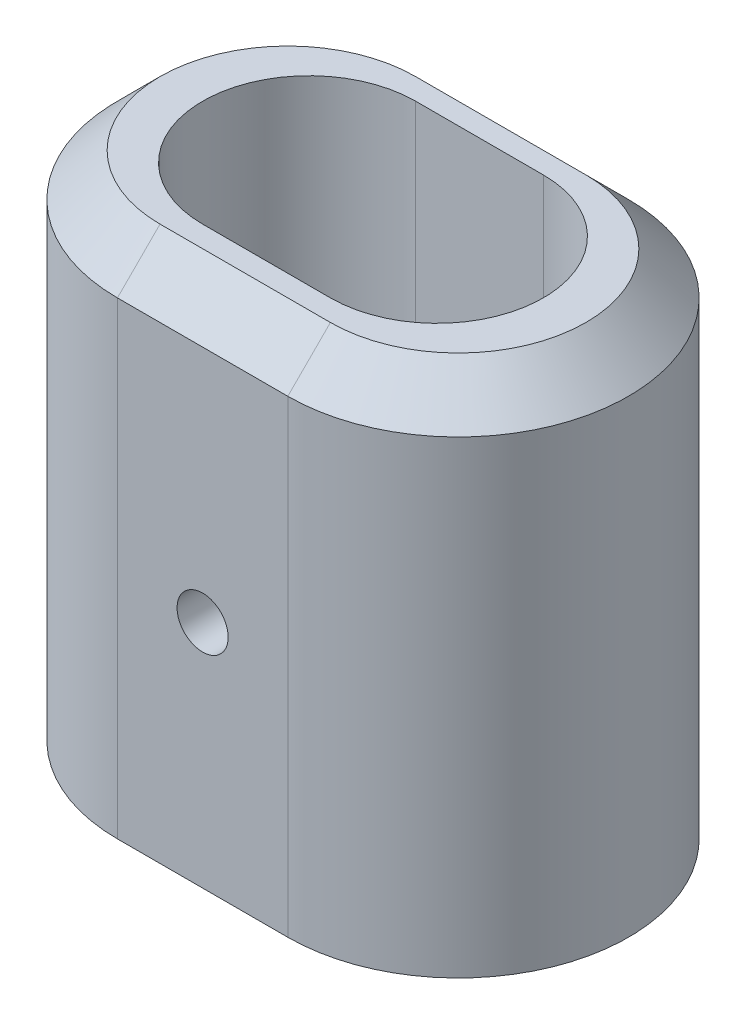
ISO-10303-21;
HEADER;
FILE_DESCRIPTION(('STEP AP214'),'2;1');
FILE_NAME('part.step','',(''),(''),'','','');
FILE_SCHEMA(('AUTOMOTIVE_DESIGN { 1 0 10303 214 1 1 1 1 }'));
ENDSEC;
DATA;
#1=APPLICATION_CONTEXT('core data for automotive mechanical design processes');
#2=APPLICATION_PROTOCOL_DEFINITION('international standard','automotive_design',2000,#1);
#3=PRODUCT_CONTEXT('',#1,'mechanical');
#4=PRODUCT('Part','Part','',(#3));
#5=PRODUCT_RELATED_PRODUCT_CATEGORY('part','',(#4));
#6=PRODUCT_DEFINITION_FORMATION('','',#4);
#7=PRODUCT_DEFINITION_CONTEXT('part definition',#1,'design');
#8=PRODUCT_DEFINITION('design','',#6,#7);
#9=PRODUCT_DEFINITION_SHAPE('','',#8);
#10=(LENGTH_UNIT() NAMED_UNIT(*) SI_UNIT(.MILLI.,.METRE.));
#11=(NAMED_UNIT(*) PLANE_ANGLE_UNIT() SI_UNIT($,.RADIAN.));
#12=(NAMED_UNIT(*) SI_UNIT($,.STERADIAN.) SOLID_ANGLE_UNIT());
#13=UNCERTAINTY_MEASURE_WITH_UNIT(LENGTH_MEASURE(1.E-05),#10,'distance_accuracy_value','');
#14=(GEOMETRIC_REPRESENTATION_CONTEXT(3) GLOBAL_UNCERTAINTY_ASSIGNED_CONTEXT((#13)) GLOBAL_UNIT_ASSIGNED_CONTEXT((#10,
#11,#12)) REPRESENTATION_CONTEXT('',''));
#15=CARTESIAN_POINT('',(0.,0.,0.));
#16=DIRECTION('',(0.,0.,1.));
#17=DIRECTION('',(1.,0.,0.));
#18=AXIS2_PLACEMENT_3D('',#15,#16,#17);
#19=CARTESIAN_POINT('',(-2.5,60.,0.));
#20=DIRECTION('',(0.,1.,0.));
#21=DIRECTION('',(0.,0.,1.));
#22=AXIS2_PLACEMENT_3D('',#19,#20,#21);
#23=PLANE('',#22);
#24=DIRECTION('',(-1.,0.,0.));
#25=VECTOR('',#24,1.);
#26=CARTESIAN_POINT('',(-2.5,60.,-15.));
#27=LINE('',#26,#25);
#28=CARTESIAN_POINT('',(17.5,60.,-15.));
#29=VERTEX_POINT('',#28);
#30=CARTESIAN_POINT('',(-2.5,60.,-15.));
#31=VERTEX_POINT('',#30);
#32=EDGE_CURVE('E185',#29,#31,#27,.T.);
#33=ORIENTED_EDGE('',*,*,#32,.T.);
#34=CARTESIAN_POINT('',(-2.5,60.,0.));
#35=DIRECTION('',(0.,1.,0.));
#36=DIRECTION('',(0.,0.,1.));
#37=AXIS2_PLACEMENT_3D('',#34,#35,#36);
#38=CIRCLE('',#37,15.);
#39=CARTESIAN_POINT('',(-2.5,60.,15.));
#40=VERTEX_POINT('',#39);
#41=EDGE_CURVE('E187',#31,#40,#38,.T.);
#42=ORIENTED_EDGE('',*,*,#41,.T.);
#43=DIRECTION('',(1.,0.,0.));
#44=VECTOR('',#43,1.);
#45=CARTESIAN_POINT('',(17.5,60.,15.));
#46=LINE('',#45,#44);
#47=CARTESIAN_POINT('',(17.5,60.,15.));
#48=VERTEX_POINT('',#47);
#49=EDGE_CURVE('E181',#40,#48,#46,.T.);
#50=ORIENTED_EDGE('',*,*,#49,.T.);
#51=CARTESIAN_POINT('',(17.5,60.,0.));
#52=DIRECTION('',(0.,1.,0.));
#53=DIRECTION('',(0.,0.,1.));
#54=AXIS2_PLACEMENT_3D('',#51,#52,#53);
#55=CIRCLE('',#54,15.);
#56=EDGE_CURVE('E183',#48,#29,#55,.T.);
#57=ORIENTED_EDGE('',*,*,#56,.T.);
#58=EDGE_LOOP('',(#33,#42,#50,#57));
#59=FACE_BOUND('',#58,.T.);
#60=DIRECTION('',(1.,0.,0.));
#61=VECTOR('',#60,1.);
#62=CARTESIAN_POINT('',(0.,60.,12.5));
#63=LINE('',#62,#61);
#64=CARTESIAN_POINT('',(0.,60.,12.5));
#65=VERTEX_POINT('',#64);
#66=CARTESIAN_POINT('',(15.,60.,12.5));
#67=VERTEX_POINT('',#66);
#68=EDGE_CURVE('E129',#65,#67,#63,.T.);
#69=ORIENTED_EDGE('',*,*,#68,.F.);
#70=CARTESIAN_POINT('',(0.,60.,0.));
#71=DIRECTION('',(0.,1.,0.));
#72=DIRECTION('',(0.,0.,1.));
#73=AXIS2_PLACEMENT_3D('',#70,#71,#72);
#74=CIRCLE('',#73,12.5);
#75=CARTESIAN_POINT('',(0.,60.,-12.5));
#76=VERTEX_POINT('',#75);
#77=EDGE_CURVE('E119',#76,#65,#74,.T.);
#78=ORIENTED_EDGE('',*,*,#77,.F.);
#79=DIRECTION('',(-1.,0.,0.));
#80=VECTOR('',#79,1.);
#81=CARTESIAN_POINT('',(0.,60.,-12.5));
#82=LINE('',#81,#80);
#83=CARTESIAN_POINT('',(15.,60.,-12.5));
#84=VERTEX_POINT('',#83);
#85=EDGE_CURVE('E144',#84,#76,#82,.T.);
#86=ORIENTED_EDGE('',*,*,#85,.F.);
#87=CARTESIAN_POINT('',(15.,60.,0.));
#88=DIRECTION('',(0.,1.,0.));
#89=DIRECTION('',(0.,0.,1.));
#90=AXIS2_PLACEMENT_3D('',#87,#88,#89);
#91=CIRCLE('',#90,12.5);
#92=EDGE_CURVE('E142',#67,#84,#91,.T.);
#93=ORIENTED_EDGE('',*,*,#92,.F.);
#94=EDGE_LOOP('',(#69,#78,#86,#93));
#95=FACE_BOUND('',#94,.T.);
#96=ADVANCED_FACE('F39',(#59,#95),#23,.T.);
#97=CARTESIAN_POINT('',(-2.5,0.,0.));
#98=DIRECTION('',(0.,1.,0.));
#99=DIRECTION('',(0.,0.,1.));
#100=AXIS2_PLACEMENT_3D('',#97,#98,#99);
#101=PLANE('',#100);
#102=CARTESIAN_POINT('',(-2.5,0.,0.));
#103=DIRECTION('',(0.,1.,0.));
#104=DIRECTION('',(0.,0.,1.));
#105=AXIS2_PLACEMENT_3D('',#102,#103,#104);
#106=CIRCLE('',#105,20.);
#107=CARTESIAN_POINT('',(-2.5,0.,-20.));
#108=VERTEX_POINT('',#107);
#109=CARTESIAN_POINT('',(-2.5,0.,20.));
#110=VERTEX_POINT('',#109);
#111=EDGE_CURVE('E137',#108,#110,#106,.T.);
#112=ORIENTED_EDGE('',*,*,#111,.F.);
#113=DIRECTION('',(-1.,0.,0.));
#114=VECTOR('',#113,1.);
#115=CARTESIAN_POINT('',(-2.5,0.,-20.));
#116=LINE('',#115,#114);
#117=CARTESIAN_POINT('',(17.5,0.,-20.));
#118=VERTEX_POINT('',#117);
#119=EDGE_CURVE('E170',#118,#108,#116,.T.);
#120=ORIENTED_EDGE('',*,*,#119,.F.);
#121=CARTESIAN_POINT('',(17.5,0.,0.));
#122=DIRECTION('',(0.,1.,0.));
#123=DIRECTION('',(0.,0.,1.));
#124=AXIS2_PLACEMENT_3D('',#121,#122,#123);
#125=CIRCLE('',#124,20.);
#126=CARTESIAN_POINT('',(17.5,0.,20.));
#127=VERTEX_POINT('',#126);
#128=EDGE_CURVE('E167',#127,#118,#125,.T.);
#129=ORIENTED_EDGE('',*,*,#128,.F.);
#130=DIRECTION('',(1.,0.,0.));
#131=VECTOR('',#130,1.);
#132=CARTESIAN_POINT('',(-2.5,0.,20.));
#133=LINE('',#132,#131);
#134=EDGE_CURVE('E164',#110,#127,#133,.T.);
#135=ORIENTED_EDGE('',*,*,#134,.F.);
#136=EDGE_LOOP('',(#112,#120,#129,#135));
#137=FACE_BOUND('',#136,.T.);
#138=CARTESIAN_POINT('',(0.,0.,0.));
#139=DIRECTION('',(0.,1.,0.));
#140=DIRECTION('',(0.,0.,1.));
#141=AXIS2_PLACEMENT_3D('',#138,#139,#140);
#142=CIRCLE('',#141,12.5);
#143=CARTESIAN_POINT('',(0.,0.,-12.5));
#144=VERTEX_POINT('',#143);
#145=CARTESIAN_POINT('',(0.,0.,12.5));
#146=VERTEX_POINT('',#145);
#147=EDGE_CURVE('E149',#144,#146,#142,.T.);
#148=ORIENTED_EDGE('',*,*,#147,.T.);
#149=DIRECTION('',(1.,0.,0.));
#150=VECTOR('',#149,1.);
#151=CARTESIAN_POINT('',(0.,0.,12.5));
#152=LINE('',#151,#150);
#153=CARTESIAN_POINT('',(15.,0.,12.5));
#154=VERTEX_POINT('',#153);
#155=EDGE_CURVE('E136',#146,#154,#152,.T.);
#156=ORIENTED_EDGE('',*,*,#155,.T.);
#157=CARTESIAN_POINT('',(15.,0.,0.));
#158=DIRECTION('',(0.,1.,0.));
#159=DIRECTION('',(0.,0.,1.));
#160=AXIS2_PLACEMENT_3D('',#157,#158,#159);
#161=CIRCLE('',#160,12.5);
#162=CARTESIAN_POINT('',(15.,0.,-12.5));
#163=VERTEX_POINT('',#162);
#164=EDGE_CURVE('E153',#154,#163,#161,.T.);
#165=ORIENTED_EDGE('',*,*,#164,.T.);
#166=DIRECTION('',(-1.,0.,0.));
#167=VECTOR('',#166,1.);
#168=CARTESIAN_POINT('',(0.,0.,-12.5));
#169=LINE('',#168,#167);
#170=EDGE_CURVE('E130',#163,#144,#169,.T.);
#171=ORIENTED_EDGE('',*,*,#170,.T.);
#172=EDGE_LOOP('',(#148,#156,#165,#171));
#173=FACE_BOUND('',#172,.T.);
#174=ADVANCED_FACE('F229',(#137,#173),#101,.F.);
#175=CARTESIAN_POINT('',(-2.5,60.,0.));
#176=DIRECTION('',(0.,-1.,0.));
#177=DIRECTION('',(0.,0.,-1.));
#178=AXIS2_PLACEMENT_3D('',#175,#176,#177);
#179=CYLINDRICAL_SURFACE('',#178,20.);
#180=DIRECTION('',(0.,-1.,0.));
#181=VECTOR('',#180,1.);
#182=CARTESIAN_POINT('',(-2.5,60.,20.));
#183=LINE('',#182,#181);
#184=CARTESIAN_POINT('',(-2.5,55.,20.));
#185=VERTEX_POINT('',#184);
#186=EDGE_CURVE('E179',#185,#110,#183,.T.);
#187=ORIENTED_EDGE('',*,*,#186,.F.);
#188=CARTESIAN_POINT('',(-2.5,55.,0.));
#189=DIRECTION('',(0.,1.,0.));
#190=DIRECTION('',(0.,0.,1.));
#191=AXIS2_PLACEMENT_3D('',#188,#189,#190);
#192=CIRCLE('',#191,20.);
#193=CARTESIAN_POINT('',(-2.5,55.,-20.));
#194=VERTEX_POINT('',#193);
#195=EDGE_CURVE('E190',#185,#194,#192,.F.);
#196=ORIENTED_EDGE('',*,*,#195,.T.);
#197=DIRECTION('',(0.,-1.,0.));
#198=VECTOR('',#197,1.);
#199=CARTESIAN_POINT('',(-2.5,60.,-20.));
#200=LINE('',#199,#198);
#201=EDGE_CURVE('E173',#194,#108,#200,.T.);
#202=ORIENTED_EDGE('',*,*,#201,.T.);
#203=ORIENTED_EDGE('',*,*,#111,.T.);
#204=EDGE_LOOP('',(#187,#196,#202,#203));
#205=FACE_BOUND('',#204,.T.);
#206=ADVANCED_FACE('F222',(#205),#179,.T.);
#207=CARTESIAN_POINT('',(-2.5,60.,20.));
#208=DIRECTION('',(0.,0.,-1.));
#209=DIRECTION('',(-1.,0.,0.));
#210=AXIS2_PLACEMENT_3D('',#207,#208,#209);
#211=PLANE('',#210);
#212=CARTESIAN_POINT('',(7.5,27.,20.));
#213=DIRECTION('',(0.,0.,1.));
#214=DIRECTION('',(1.,0.,0.));
#215=AXIS2_PLACEMENT_3D('',#212,#213,#214);
#216=CIRCLE('',#215,3.);
#217=CARTESIAN_POINT('',(10.5,27.,20.));
#218=VERTEX_POINT('',#217);
#219=EDGE_CURVE('E295',#218,#218,#216,.T.);
#220=ORIENTED_EDGE('',*,*,#219,.F.);
#221=EDGE_LOOP('',(#220));
#222=FACE_BOUND('',#221,.T.);
#223=DIRECTION('',(0.,-1.,0.));
#224=VECTOR('',#223,1.);
#225=CARTESIAN_POINT('',(17.5,60.,20.));
#226=LINE('',#225,#224);
#227=CARTESIAN_POINT('',(17.5,55.,20.));
#228=VERTEX_POINT('',#227);
#229=EDGE_CURVE('E177',#228,#127,#226,.T.);
#230=ORIENTED_EDGE('',*,*,#229,.F.);
#231=DIRECTION('',(-1.,0.,0.));
#232=VECTOR('',#231,1.);
#233=CARTESIAN_POINT('',(-2.5,55.,20.));
#234=LINE('',#233,#232);
#235=EDGE_CURVE('E11',#228,#185,#234,.T.);
#236=ORIENTED_EDGE('',*,*,#235,.T.);
#237=ORIENTED_EDGE('',*,*,#186,.T.);
#238=ORIENTED_EDGE('',*,*,#134,.T.);
#239=EDGE_LOOP('',(#230,#236,#237,#238));
#240=FACE_BOUND('',#239,.T.);
#241=ADVANCED_FACE('F218',(#222,#240),#211,.F.);
#242=CARTESIAN_POINT('',(17.5,60.,0.));
#243=DIRECTION('',(0.,-1.,0.));
#244=DIRECTION('',(0.,0.,-1.));
#245=AXIS2_PLACEMENT_3D('',#242,#243,#244);
#246=CYLINDRICAL_SURFACE('',#245,20.);
#247=DIRECTION('',(0.,-1.,0.));
#248=VECTOR('',#247,1.);
#249=CARTESIAN_POINT('',(17.5,60.,-20.));
#250=LINE('',#249,#248);
#251=CARTESIAN_POINT('',(17.5,55.,-20.));
#252=VERTEX_POINT('',#251);
#253=EDGE_CURVE('E175',#252,#118,#250,.T.);
#254=ORIENTED_EDGE('',*,*,#253,.F.);
#255=CARTESIAN_POINT('',(17.5,55.,0.));
#256=DIRECTION('',(0.,1.,0.));
#257=DIRECTION('',(0.,0.,1.));
#258=AXIS2_PLACEMENT_3D('',#255,#256,#257);
#259=CIRCLE('',#258,20.);
#260=EDGE_CURVE('E49',#252,#228,#259,.F.);
#261=ORIENTED_EDGE('',*,*,#260,.T.);
#262=ORIENTED_EDGE('',*,*,#229,.T.);
#263=ORIENTED_EDGE('',*,*,#128,.T.);
#264=EDGE_LOOP('',(#254,#261,#262,#263));
#265=FACE_BOUND('',#264,.T.);
#266=ADVANCED_FACE('F242',(#265),#246,.T.);
#267=CARTESIAN_POINT('',(-2.5,60.,-20.));
#268=DIRECTION('',(0.,0.,1.));
#269=DIRECTION('',(1.,0.,0.));
#270=AXIS2_PLACEMENT_3D('',#267,#268,#269);
#271=PLANE('',#270);
#272=CARTESIAN_POINT('',(7.5,27.,-20.));
#273=DIRECTION('',(0.,0.,1.));
#274=DIRECTION('',(1.,0.,0.));
#275=AXIS2_PLACEMENT_3D('',#272,#273,#274);
#276=CIRCLE('',#275,3.);
#277=CARTESIAN_POINT('',(10.5,27.,-20.));
#278=VERTEX_POINT('',#277);
#279=EDGE_CURVE('E198',#278,#278,#276,.T.);
#280=ORIENTED_EDGE('',*,*,#279,.T.);
#281=EDGE_LOOP('',(#280));
#282=FACE_BOUND('',#281,.T.);
#283=ORIENTED_EDGE('',*,*,#201,.F.);
#284=DIRECTION('',(1.,0.,0.));
#285=VECTOR('',#284,1.);
#286=CARTESIAN_POINT('',(17.5,55.,-20.));
#287=LINE('',#286,#285);
#288=EDGE_CURVE('E64',#194,#252,#287,.T.);
#289=ORIENTED_EDGE('',*,*,#288,.T.);
#290=ORIENTED_EDGE('',*,*,#253,.T.);
#291=ORIENTED_EDGE('',*,*,#119,.T.);
#292=EDGE_LOOP('',(#283,#289,#290,#291));
#293=FACE_BOUND('',#292,.T.);
#294=ADVANCED_FACE('F239',(#282,#293),#271,.F.);
#295=CARTESIAN_POINT('',(0.,60.,0.));
#296=DIRECTION('',(0.,-1.,0.));
#297=DIRECTION('',(0.,0.,-1.));
#298=AXIS2_PLACEMENT_3D('',#295,#296,#297);
#299=CYLINDRICAL_SURFACE('',#298,12.5);
#300=ORIENTED_EDGE('',*,*,#147,.F.);
#301=DIRECTION('',(0.,-1.,0.));
#302=VECTOR('',#301,1.);
#303=CARTESIAN_POINT('',(0.,60.,-12.5));
#304=LINE('',#303,#302);
#305=EDGE_CURVE('E125',#76,#144,#304,.T.);
#306=ORIENTED_EDGE('',*,*,#305,.F.);
#307=ORIENTED_EDGE('',*,*,#77,.T.);
#308=DIRECTION('',(0.,-1.,0.));
#309=VECTOR('',#308,1.);
#310=CARTESIAN_POINT('',(0.,60.,12.5));
#311=LINE('',#310,#309);
#312=EDGE_CURVE('E122',#65,#146,#311,.T.);
#313=ORIENTED_EDGE('',*,*,#312,.T.);
#314=EDGE_LOOP('',(#300,#306,#307,#313));
#315=FACE_BOUND('',#314,.T.);
#316=ADVANCED_FACE('F121',(#315),#299,.F.);
#317=CARTESIAN_POINT('',(0.,60.,12.5));
#318=DIRECTION('',(0.,0.,-1.));
#319=DIRECTION('',(-1.,0.,0.));
#320=AXIS2_PLACEMENT_3D('',#317,#318,#319);
#321=PLANE('',#320);
#322=CARTESIAN_POINT('',(7.5,27.,12.5));
#323=DIRECTION('',(0.,0.,-1.));
#324=DIRECTION('',(-1.,0.,0.));
#325=AXIS2_PLACEMENT_3D('',#322,#323,#324);
#326=CIRCLE('',#325,3.);
#327=CARTESIAN_POINT('',(4.5,27.,12.5));
#328=VERTEX_POINT('',#327);
#329=EDGE_CURVE('E290',#328,#328,#326,.T.);
#330=ORIENTED_EDGE('',*,*,#329,.F.);
#331=EDGE_LOOP('',(#330));
#332=FACE_BOUND('',#331,.T.);
#333=ORIENTED_EDGE('',*,*,#155,.F.);
#334=ORIENTED_EDGE('',*,*,#312,.F.);
#335=ORIENTED_EDGE('',*,*,#68,.T.);
#336=DIRECTION('',(0.,-1.,0.));
#337=VECTOR('',#336,1.);
#338=CARTESIAN_POINT('',(15.,60.,12.5));
#339=LINE('',#338,#337);
#340=EDGE_CURVE('E138',#67,#154,#339,.T.);
#341=ORIENTED_EDGE('',*,*,#340,.T.);
#342=EDGE_LOOP('',(#333,#334,#335,#341));
#343=FACE_BOUND('',#342,.T.);
#344=ADVANCED_FACE('F133',(#332,#343),#321,.T.);
#345=CARTESIAN_POINT('',(15.,60.,0.));
#346=DIRECTION('',(0.,-1.,0.));
#347=DIRECTION('',(0.,0.,-1.));
#348=AXIS2_PLACEMENT_3D('',#345,#346,#347);
#349=CYLINDRICAL_SURFACE('',#348,12.5);
#350=ORIENTED_EDGE('',*,*,#164,.F.);
#351=ORIENTED_EDGE('',*,*,#340,.F.);
#352=ORIENTED_EDGE('',*,*,#92,.T.);
#353=DIRECTION('',(0.,-1.,0.));
#354=VECTOR('',#353,1.);
#355=CARTESIAN_POINT('',(15.,60.,-12.5));
#356=LINE('',#355,#354);
#357=EDGE_CURVE('E159',#84,#163,#356,.T.);
#358=ORIENTED_EDGE('',*,*,#357,.T.);
#359=EDGE_LOOP('',(#350,#351,#352,#358));
#360=FACE_BOUND('',#359,.T.);
#361=ADVANCED_FACE('F272',(#360),#349,.F.);
#362=CARTESIAN_POINT('',(0.,60.,-12.5));
#363=DIRECTION('',(0.,0.,1.));
#364=DIRECTION('',(1.,0.,0.));
#365=AXIS2_PLACEMENT_3D('',#362,#363,#364);
#366=PLANE('',#365);
#367=CARTESIAN_POINT('',(7.5,27.,-12.5));
#368=DIRECTION('',(0.,0.,1.));
#369=DIRECTION('',(1.,0.,0.));
#370=AXIS2_PLACEMENT_3D('',#367,#368,#369);
#371=CIRCLE('',#370,3.);
#372=CARTESIAN_POINT('',(10.5,27.,-12.5));
#373=VERTEX_POINT('',#372);
#374=EDGE_CURVE('E44',#373,#373,#371,.T.);
#375=ORIENTED_EDGE('',*,*,#374,.F.);
#376=EDGE_LOOP('',(#375));
#377=FACE_BOUND('',#376,.T.);
#378=ORIENTED_EDGE('',*,*,#170,.F.);
#379=ORIENTED_EDGE('',*,*,#357,.F.);
#380=ORIENTED_EDGE('',*,*,#85,.T.);
#381=ORIENTED_EDGE('',*,*,#305,.T.);
#382=EDGE_LOOP('',(#378,#379,#380,#381));
#383=FACE_BOUND('',#382,.T.);
#384=ADVANCED_FACE('F268',(#377,#383),#366,.T.);
#385=CARTESIAN_POINT('',(17.5,60.,0.));
#386=DIRECTION('',(0.,-1.,0.));
#387=DIRECTION('',(0.,0.,-1.));
#388=AXIS2_PLACEMENT_3D('',#385,#386,#387);
#389=CONICAL_SURFACE('',#388,15.,0.785398163397447);
#390=DIRECTION('',(0.,0.707106781186548,-0.707106781186546));
#391=VECTOR('',#390,1.);
#392=CARTESIAN_POINT('',(17.5,55.,20.));
#393=LINE('',#392,#391);
#394=EDGE_CURVE('E200',#228,#48,#393,.T.);
#395=ORIENTED_EDGE('',*,*,#394,.F.);
#396=ORIENTED_EDGE('',*,*,#260,.F.);
#397=DIRECTION('',(0.,-0.707106781186548,-0.707106781186546));
#398=VECTOR('',#397,1.);
#399=CARTESIAN_POINT('',(17.5,60.,-15.));
#400=LINE('',#399,#398);
#401=EDGE_CURVE('E151',#29,#252,#400,.T.);
#402=ORIENTED_EDGE('',*,*,#401,.F.);
#403=ORIENTED_EDGE('',*,*,#56,.F.);
#404=EDGE_LOOP('',(#395,#396,#402,#403));
#405=FACE_BOUND('',#404,.T.);
#406=ADVANCED_FACE('F42',(#405),#389,.T.);
#407=CARTESIAN_POINT('',(-2.5,60.,-15.));
#408=DIRECTION('',(0.,0.707106781186546,-0.707106781186548));
#409=DIRECTION('',(1.,0.,0.));
#410=AXIS2_PLACEMENT_3D('',#407,#408,#409);
#411=PLANE('',#410);
#412=ORIENTED_EDGE('',*,*,#401,.T.);
#413=ORIENTED_EDGE('',*,*,#288,.F.);
#414=DIRECTION('',(0.,-0.707106781186548,-0.707106781186546));
#415=VECTOR('',#414,1.);
#416=CARTESIAN_POINT('',(-2.5,60.,-15.));
#417=LINE('',#416,#415);
#418=EDGE_CURVE('E197',#31,#194,#417,.T.);
#419=ORIENTED_EDGE('',*,*,#418,.F.);
#420=ORIENTED_EDGE('',*,*,#32,.F.);
#421=EDGE_LOOP('',(#412,#413,#419,#420));
#422=FACE_BOUND('',#421,.T.);
#423=ADVANCED_FACE('F206',(#422),#411,.T.);
#424=CARTESIAN_POINT('',(-2.5,60.,15.));
#425=DIRECTION('',(0.,0.707106781186546,0.707106781186548));
#426=DIRECTION('',(-1.,0.,0.));
#427=AXIS2_PLACEMENT_3D('',#424,#425,#426);
#428=PLANE('',#427);
#429=ORIENTED_EDGE('',*,*,#394,.T.);
#430=ORIENTED_EDGE('',*,*,#49,.F.);
#431=DIRECTION('',(0.,0.707106781186548,-0.707106781186546));
#432=VECTOR('',#431,1.);
#433=CARTESIAN_POINT('',(-2.5,55.,20.));
#434=LINE('',#433,#432);
#435=EDGE_CURVE('E195',#185,#40,#434,.T.);
#436=ORIENTED_EDGE('',*,*,#435,.F.);
#437=ORIENTED_EDGE('',*,*,#235,.F.);
#438=EDGE_LOOP('',(#429,#430,#436,#437));
#439=FACE_BOUND('',#438,.T.);
#440=ADVANCED_FACE('F215',(#439),#428,.T.);
#441=CARTESIAN_POINT('',(-2.5,60.,0.));
#442=DIRECTION('',(0.,-1.,0.));
#443=DIRECTION('',(0.,0.,-1.));
#444=AXIS2_PLACEMENT_3D('',#441,#442,#443);
#445=CONICAL_SURFACE('',#444,15.,0.785398163397447);
#446=ORIENTED_EDGE('',*,*,#418,.T.);
#447=ORIENTED_EDGE('',*,*,#195,.F.);
#448=ORIENTED_EDGE('',*,*,#435,.T.);
#449=ORIENTED_EDGE('',*,*,#41,.F.);
#450=EDGE_LOOP('',(#446,#447,#448,#449));
#451=FACE_BOUND('',#450,.T.);
#452=ADVANCED_FACE('F225',(#451),#445,.T.);
#453=CARTESIAN_POINT('',(7.5,27.,-40.));
#454=DIRECTION('',(0.,0.,1.));
#455=DIRECTION('',(1.,0.,0.));
#456=AXIS2_PLACEMENT_3D('',#453,#454,#455);
#457=CYLINDRICAL_SURFACE('',#456,3.);
#458=ORIENTED_EDGE('',*,*,#374,.T.);
#459=EDGE_LOOP('',(#458));
#460=FACE_BOUND('',#459,.T.);
#461=ORIENTED_EDGE('',*,*,#279,.F.);
#462=EDGE_LOOP('',(#461));
#463=FACE_BOUND('',#462,.T.);
#464=ADVANCED_FACE('F257',(#460,#463),#457,.F.);
#465=ORIENTED_EDGE('',*,*,#329,.T.);
#466=EDGE_LOOP('',(#465));
#467=FACE_BOUND('',#466,.T.);
#468=ORIENTED_EDGE('',*,*,#219,.T.);
#469=EDGE_LOOP('',(#468));
#470=FACE_BOUND('',#469,.T.);
#471=ADVANCED_FACE('F300',(#467,#470),#457,.F.);
#472=CLOSED_SHELL('',(#96,#174,#206,#241,#266,#294,#316,#344,#361,#384,#406,#423,#440,#452,#464,#471));
#473=MANIFOLD_SOLID_BREP('B2',#472);
#474=ADVANCED_BREP_SHAPE_REPRESENTATION('',(#18,#473),#14);
#475=SHAPE_DEFINITION_REPRESENTATION(#9,#474);
ENDSEC;
END-ISO-10303-21;
